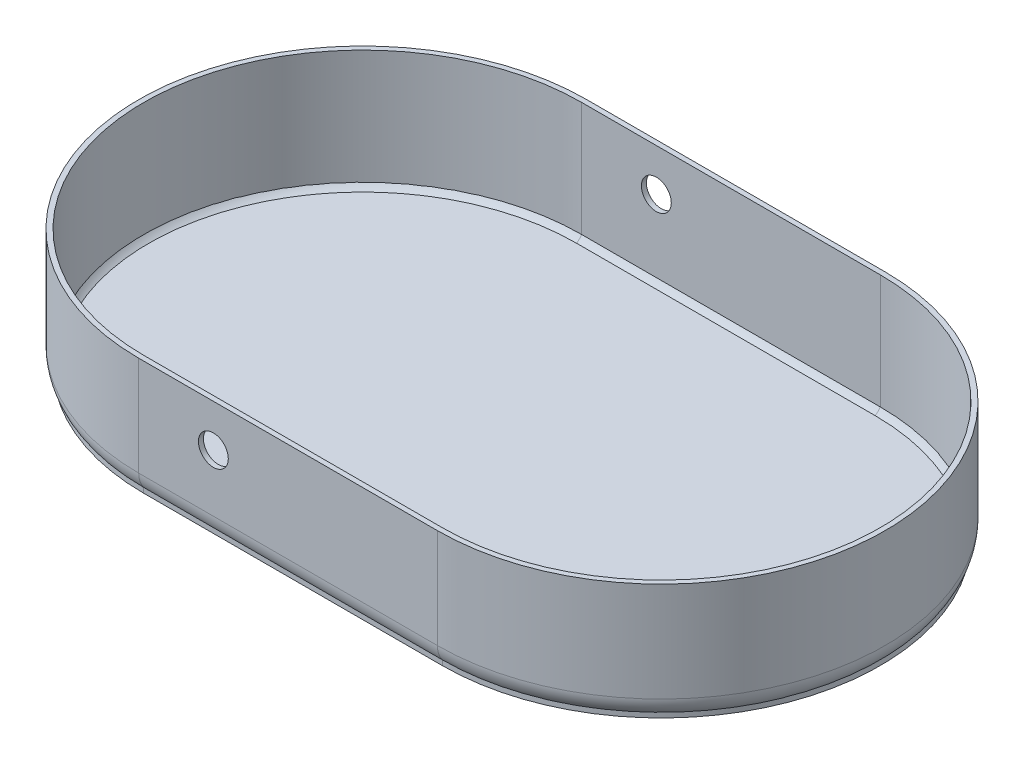
ISO-10303-21;
HEADER;
FILE_DESCRIPTION(('STEP AP214'),'2;1');
FILE_NAME('part.step','',(''),(''),'','','');
FILE_SCHEMA(('AUTOMOTIVE_DESIGN { 1 0 10303 214 1 1 1 1 }'));
ENDSEC;
DATA;
#1=APPLICATION_CONTEXT('core data for automotive mechanical design processes');
#2=APPLICATION_PROTOCOL_DEFINITION('international standard','automotive_design',2000,#1);
#3=PRODUCT_CONTEXT('',#1,'mechanical');
#4=PRODUCT('Part','Part','',(#3));
#5=PRODUCT_RELATED_PRODUCT_CATEGORY('part','',(#4));
#6=PRODUCT_DEFINITION_FORMATION('','',#4);
#7=PRODUCT_DEFINITION_CONTEXT('part definition',#1,'design');
#8=PRODUCT_DEFINITION('design','',#6,#7);
#9=PRODUCT_DEFINITION_SHAPE('','',#8);
#10=(LENGTH_UNIT() NAMED_UNIT(*) SI_UNIT(.MILLI.,.METRE.));
#11=(NAMED_UNIT(*) PLANE_ANGLE_UNIT() SI_UNIT($,.RADIAN.));
#12=(NAMED_UNIT(*) SI_UNIT($,.STERADIAN.) SOLID_ANGLE_UNIT());
#13=UNCERTAINTY_MEASURE_WITH_UNIT(LENGTH_MEASURE(1.E-05),#10,'distance_accuracy_value','');
#14=(GEOMETRIC_REPRESENTATION_CONTEXT(3) GLOBAL_UNCERTAINTY_ASSIGNED_CONTEXT((#13)) GLOBAL_UNIT_ASSIGNED_CONTEXT((#10,
#11,#12)) REPRESENTATION_CONTEXT('',''));
#15=CARTESIAN_POINT('',(0.,0.,0.));
#16=DIRECTION('',(0.,0.,1.));
#17=DIRECTION('',(1.,0.,0.));
#18=AXIS2_PLACEMENT_3D('',#15,#16,#17);
#19=CARTESIAN_POINT('',(-99.917940375915,2.,303.043690249905));
#20=DIRECTION('',(0.,1.,0.));
#21=DIRECTION('',(0.,0.,1.));
#22=AXIS2_PLACEMENT_3D('',#19,#20,#21);
#23=PLANE('',#22);
#24=DIRECTION('',(1.,0.,0.));
#25=VECTOR('',#24,1.);
#26=CARTESIAN_POINT('',(-99.917940375915,2.,215.043690249905));
#27=LINE('',#26,#25);
#28=CARTESIAN_POINT('',(-99.917940375915,2.,215.043690249905));
#29=VERTEX_POINT('',#28);
#30=CARTESIAN_POINT('',(20.0820596240851,2.,215.043690249905));
#31=VERTEX_POINT('',#30);
#32=EDGE_CURVE('E129',#29,#31,#27,.T.);
#33=ORIENTED_EDGE('',*,*,#32,.F.);
#34=CARTESIAN_POINT('',(-99.917940375915,2.,303.043690249905));
#35=DIRECTION('',(0.,1.,0.));
#36=DIRECTION('',(0.,0.,-1.));
#37=AXIS2_PLACEMENT_3D('',#34,#35,#36);
#38=CIRCLE('',#37,88.);
#39=CARTESIAN_POINT('',(-99.917940375915,2.,391.043690249905));
#40=VERTEX_POINT('',#39);
#41=EDGE_CURVE('E114',#29,#40,#38,.T.);
#42=ORIENTED_EDGE('',*,*,#41,.T.);
#43=DIRECTION('',(1.,0.,0.));
#44=VECTOR('',#43,1.);
#45=CARTESIAN_POINT('',(-99.917940375915,2.,391.043690249905));
#46=LINE('',#45,#44);
#47=CARTESIAN_POINT('',(20.0820596240851,2.,391.043690249905));
#48=VERTEX_POINT('',#47);
#49=EDGE_CURVE('E160',#40,#48,#46,.T.);
#50=ORIENTED_EDGE('',*,*,#49,.T.);
#51=CARTESIAN_POINT('',(20.0820596240851,2.,303.043690249905));
#52=DIRECTION('',(0.,1.,0.));
#53=DIRECTION('',(0.,0.,1.));
#54=AXIS2_PLACEMENT_3D('',#51,#52,#53);
#55=CIRCLE('',#54,88.);
#56=EDGE_CURVE('E131',#48,#31,#55,.T.);
#57=ORIENTED_EDGE('',*,*,#56,.T.);
#58=EDGE_LOOP('',(#33,#42,#50,#57));
#59=FACE_BOUND('',#58,.T.);
#60=ADVANCED_FACE('F37',(#59),#23,.T.);
#61=CARTESIAN_POINT('',(-99.917940375915,2.,303.043690249905));
#62=DIRECTION('',(0.,-1.,0.));
#63=DIRECTION('',(0.,0.,-1.));
#64=AXIS2_PLACEMENT_3D('',#61,#62,#63);
#65=CYLINDRICAL_SURFACE('',#64,90.);
#66=DIRECTION('',(0.,-1.,0.));
#67=VECTOR('',#66,1.);
#68=CARTESIAN_POINT('',(-99.917940375915,2.,213.043690249905));
#69=LINE('',#68,#67);
#70=CARTESIAN_POINT('',(-99.917940375915,50.,213.043690249905));
#71=VERTEX_POINT('',#70);
#72=CARTESIAN_POINT('',(-99.917940375915,10.,213.043690249905));
#73=VERTEX_POINT('',#72);
#74=EDGE_CURVE('E168',#71,#73,#69,.T.);
#75=ORIENTED_EDGE('',*,*,#74,.T.);
#76=CARTESIAN_POINT('',(-99.917940375915,10.,303.043690249905));
#77=DIRECTION('',(0.,1.,0.));
#78=DIRECTION('',(0.,0.,1.));
#79=AXIS2_PLACEMENT_3D('',#76,#77,#78);
#80=CIRCLE('',#79,90.);
#81=CARTESIAN_POINT('',(-99.917940375915,10.,393.043690249905));
#82=VERTEX_POINT('',#81);
#83=EDGE_CURVE('E11',#73,#82,#80,.T.);
#84=ORIENTED_EDGE('',*,*,#83,.T.);
#85=DIRECTION('',(0.,-1.,0.));
#86=VECTOR('',#85,1.);
#87=CARTESIAN_POINT('',(-99.917940375915,2.,393.043690249905));
#88=LINE('',#87,#86);
#89=CARTESIAN_POINT('',(-99.917940375915,50.,393.043690249905));
#90=VERTEX_POINT('',#89);
#91=EDGE_CURVE('E176',#90,#82,#88,.T.);
#92=ORIENTED_EDGE('',*,*,#91,.F.);
#93=CARTESIAN_POINT('',(-99.917940375915,50.,303.043690249905));
#94=DIRECTION('',(0.,1.,0.));
#95=DIRECTION('',(0.,0.,-1.));
#96=AXIS2_PLACEMENT_3D('',#93,#94,#95);
#97=CIRCLE('',#96,90.);
#98=EDGE_CURVE('E140',#71,#90,#97,.T.);
#99=ORIENTED_EDGE('',*,*,#98,.F.);
#100=EDGE_LOOP('',(#75,#84,#92,#99));
#101=FACE_BOUND('',#100,.T.);
#102=ADVANCED_FACE('F237',(#101),#65,.T.);
#103=CARTESIAN_POINT('',(-99.917940375915,2.,393.043690249905));
#104=DIRECTION('',(0.,0.,-1.));
#105=DIRECTION('',(-1.,0.,0.));
#106=AXIS2_PLACEMENT_3D('',#103,#104,#105);
#107=PLANE('',#106);
#108=CARTESIAN_POINT('',(-69.9179403759149,33.,393.043690249905));
#109=DIRECTION('',(0.,0.,1.));
#110=DIRECTION('',(1.,0.,0.));
#111=AXIS2_PLACEMENT_3D('',#108,#109,#110);
#112=CIRCLE('',#111,6.);
#113=CARTESIAN_POINT('',(-63.9179403759149,33.,393.043690249905));
#114=VERTEX_POINT('',#113);
#115=EDGE_CURVE('E184',#114,#114,#112,.T.);
#116=ORIENTED_EDGE('',*,*,#115,.F.);
#117=EDGE_LOOP('',(#116));
#118=FACE_BOUND('',#117,.T.);
#119=ORIENTED_EDGE('',*,*,#91,.T.);
#120=DIRECTION('',(1.,0.,0.));
#121=VECTOR('',#120,1.);
#122=CARTESIAN_POINT('',(-99.917940375915,10.,393.043690249905));
#123=LINE('',#122,#121);
#124=CARTESIAN_POINT('',(20.0820596240851,10.,393.043690249905));
#125=VERTEX_POINT('',#124);
#126=EDGE_CURVE('E179',#82,#125,#123,.T.);
#127=ORIENTED_EDGE('',*,*,#126,.T.);
#128=DIRECTION('',(0.,-1.,0.));
#129=VECTOR('',#128,1.);
#130=CARTESIAN_POINT('',(20.0820596240851,2.,393.043690249905));
#131=LINE('',#130,#129);
#132=CARTESIAN_POINT('',(20.0820596240851,50.,393.043690249905));
#133=VERTEX_POINT('',#132);
#134=EDGE_CURVE('E174',#133,#125,#131,.T.);
#135=ORIENTED_EDGE('',*,*,#134,.F.);
#136=DIRECTION('',(-1.,0.,0.));
#137=VECTOR('',#136,1.);
#138=CARTESIAN_POINT('',(-99.917940375915,50.,393.043690249905));
#139=LINE('',#138,#137);
#140=EDGE_CURVE('E158',#133,#90,#139,.T.);
#141=ORIENTED_EDGE('',*,*,#140,.T.);
#142=EDGE_LOOP('',(#119,#127,#135,#141));
#143=FACE_BOUND('',#142,.T.);
#144=ADVANCED_FACE('F242',(#118,#143),#107,.F.);
#145=CARTESIAN_POINT('',(20.0820596240851,2.,303.043690249905));
#146=DIRECTION('',(0.,-1.,0.));
#147=DIRECTION('',(0.,0.,-1.));
#148=AXIS2_PLACEMENT_3D('',#145,#146,#147);
#149=CYLINDRICAL_SURFACE('',#148,90.);
#150=ORIENTED_EDGE('',*,*,#134,.T.);
#151=CARTESIAN_POINT('',(20.0820596240851,10.,303.043690249905));
#152=DIRECTION('',(0.,1.,0.));
#153=DIRECTION('',(0.,0.,1.));
#154=AXIS2_PLACEMENT_3D('',#151,#152,#153);
#155=CIRCLE('',#154,90.);
#156=CARTESIAN_POINT('',(20.0820596240851,10.,213.043690249905));
#157=VERTEX_POINT('',#156);
#158=EDGE_CURVE('E61',#125,#157,#155,.T.);
#159=ORIENTED_EDGE('',*,*,#158,.T.);
#160=DIRECTION('',(0.,-1.,0.));
#161=VECTOR('',#160,1.);
#162=CARTESIAN_POINT('',(20.0820596240851,2.,213.043690249905));
#163=LINE('',#162,#161);
#164=CARTESIAN_POINT('',(20.0820596240851,50.,213.043690249905));
#165=VERTEX_POINT('',#164);
#166=EDGE_CURVE('E172',#165,#157,#163,.T.);
#167=ORIENTED_EDGE('',*,*,#166,.F.);
#168=CARTESIAN_POINT('',(20.0820596240851,50.,303.043690249905));
#169=DIRECTION('',(0.,1.,0.));
#170=DIRECTION('',(0.,0.,1.));
#171=AXIS2_PLACEMENT_3D('',#168,#169,#170);
#172=CIRCLE('',#171,90.);
#173=EDGE_CURVE('E151',#133,#165,#172,.T.);
#174=ORIENTED_EDGE('',*,*,#173,.F.);
#175=EDGE_LOOP('',(#150,#159,#167,#174));
#176=FACE_BOUND('',#175,.T.);
#177=ADVANCED_FACE('F254',(#176),#149,.T.);
#178=CARTESIAN_POINT('',(-99.917940375915,2.,213.043690249905));
#179=DIRECTION('',(0.,0.,-1.));
#180=DIRECTION('',(-1.,0.,0.));
#181=AXIS2_PLACEMENT_3D('',#178,#179,#180);
#182=PLANE('',#181);
#183=CARTESIAN_POINT('',(-69.9179403759149,33.,213.043690249905));
#184=DIRECTION('',(0.,0.,-1.));
#185=DIRECTION('',(-1.,0.,0.));
#186=AXIS2_PLACEMENT_3D('',#183,#184,#185);
#187=CIRCLE('',#186,6.);
#188=CARTESIAN_POINT('',(-63.9179403759149,33.,213.043690249905));
#189=VERTEX_POINT('',#188);
#190=EDGE_CURVE('E126',#189,#189,#187,.T.);
#191=ORIENTED_EDGE('',*,*,#190,.F.);
#192=EDGE_LOOP('',(#191));
#193=FACE_BOUND('',#192,.T.);
#194=ORIENTED_EDGE('',*,*,#166,.T.);
#195=DIRECTION('',(1.,0.,0.));
#196=VECTOR('',#195,1.);
#197=CARTESIAN_POINT('',(-99.917940375915,10.,213.043690249905));
#198=LINE('',#197,#196);
#199=EDGE_CURVE('E46',#157,#73,#198,.F.);
#200=ORIENTED_EDGE('',*,*,#199,.T.);
#201=ORIENTED_EDGE('',*,*,#74,.F.);
#202=DIRECTION('',(1.,0.,0.));
#203=VECTOR('',#202,1.);
#204=CARTESIAN_POINT('',(-99.917940375915,50.,213.043690249905));
#205=LINE('',#204,#203);
#206=EDGE_CURVE('E146',#71,#165,#205,.T.);
#207=ORIENTED_EDGE('',*,*,#206,.T.);
#208=EDGE_LOOP('',(#194,#200,#201,#207));
#209=FACE_BOUND('',#208,.T.);
#210=ADVANCED_FACE('F250',(#193,#209),#182,.T.);
#211=CARTESIAN_POINT('',(-99.917940375915,0.,303.043690249905));
#212=DIRECTION('',(0.,1.,0.));
#213=DIRECTION('',(0.,0.,1.));
#214=AXIS2_PLACEMENT_3D('',#211,#212,#213);
#215=PLANE('',#214);
#216=CARTESIAN_POINT('',(20.0820596240851,0.,303.043690249905));
#217=DIRECTION('',(0.,1.,0.));
#218=DIRECTION('',(0.,0.,1.));
#219=AXIS2_PLACEMENT_3D('',#216,#217,#218);
#220=CIRCLE('',#219,80.);
#221=CARTESIAN_POINT('',(20.0820596240851,0.,223.043690249905));
#222=VERTEX_POINT('',#221);
#223=CARTESIAN_POINT('',(20.0820596240851,0.,383.043690249905));
#224=VERTEX_POINT('',#223);
#225=EDGE_CURVE('E191',#222,#224,#220,.F.);
#226=ORIENTED_EDGE('',*,*,#225,.T.);
#227=DIRECTION('',(1.,0.,0.));
#228=VECTOR('',#227,1.);
#229=CARTESIAN_POINT('',(-99.917940375915,0.,383.043690249905));
#230=LINE('',#229,#228);
#231=CARTESIAN_POINT('',(-99.917940375915,0.,383.043690249905));
#232=VERTEX_POINT('',#231);
#233=EDGE_CURVE('E193',#224,#232,#230,.F.);
#234=ORIENTED_EDGE('',*,*,#233,.T.);
#235=CARTESIAN_POINT('',(-99.917940375915,0.,303.043690249905));
#236=DIRECTION('',(0.,1.,0.));
#237=DIRECTION('',(0.,0.,1.));
#238=AXIS2_PLACEMENT_3D('',#235,#236,#237);
#239=CIRCLE('',#238,80.);
#240=CARTESIAN_POINT('',(-99.917940375915,0.,223.043690249905));
#241=VERTEX_POINT('',#240);
#242=EDGE_CURVE('E187',#232,#241,#239,.F.);
#243=ORIENTED_EDGE('',*,*,#242,.T.);
#244=DIRECTION('',(1.,0.,0.));
#245=VECTOR('',#244,1.);
#246=CARTESIAN_POINT('',(20.0820596240851,0.,223.043690249905));
#247=LINE('',#246,#245);
#248=EDGE_CURVE('E189',#241,#222,#247,.T.);
#249=ORIENTED_EDGE('',*,*,#248,.T.);
#250=EDGE_LOOP('',(#226,#234,#243,#249));
#251=FACE_BOUND('',#250,.T.);
#252=ADVANCED_FACE('F247',(#251),#215,.F.);
#253=CARTESIAN_POINT('',(-99.917940375915,50.,391.043690249905));
#254=DIRECTION('',(0.,1.,0.));
#255=DIRECTION('',(0.,0.,1.));
#256=AXIS2_PLACEMENT_3D('',#253,#254,#255);
#257=PLANE('',#256);
#258=ORIENTED_EDGE('',*,*,#98,.T.);
#259=ORIENTED_EDGE('',*,*,#140,.F.);
#260=ORIENTED_EDGE('',*,*,#173,.T.);
#261=ORIENTED_EDGE('',*,*,#206,.F.);
#262=EDGE_LOOP('',(#258,#259,#260,#261));
#263=FACE_BOUND('',#262,.T.);
#264=DIRECTION('',(-1.,0.,0.));
#265=VECTOR('',#264,1.);
#266=CARTESIAN_POINT('',(-99.917940375915,50.,391.043690249905));
#267=LINE('',#266,#265);
#268=CARTESIAN_POINT('',(20.0820596240851,50.,391.043690249905));
#269=VERTEX_POINT('',#268);
#270=CARTESIAN_POINT('',(-99.917940375915,50.,391.043690249905));
#271=VERTEX_POINT('',#270);
#272=EDGE_CURVE('E165',#269,#271,#267,.T.);
#273=ORIENTED_EDGE('',*,*,#272,.T.);
#274=CARTESIAN_POINT('',(-99.917940375915,50.,303.043690249905));
#275=DIRECTION('',(0.,1.,0.));
#276=DIRECTION('',(0.,0.,-1.));
#277=AXIS2_PLACEMENT_3D('',#274,#275,#276);
#278=CIRCLE('',#277,88.);
#279=CARTESIAN_POINT('',(-99.917940375915,50.,215.043690249905));
#280=VERTEX_POINT('',#279);
#281=EDGE_CURVE('E125',#280,#271,#278,.T.);
#282=ORIENTED_EDGE('',*,*,#281,.F.);
#283=DIRECTION('',(1.,0.,0.));
#284=VECTOR('',#283,1.);
#285=CARTESIAN_POINT('',(-99.917940375915,50.,215.043690249905));
#286=LINE('',#285,#284);
#287=CARTESIAN_POINT('',(20.0820596240851,50.,215.043690249905));
#288=VERTEX_POINT('',#287);
#289=EDGE_CURVE('E135',#280,#288,#286,.T.);
#290=ORIENTED_EDGE('',*,*,#289,.T.);
#291=CARTESIAN_POINT('',(20.0820596240851,50.,303.043690249905));
#292=DIRECTION('',(0.,1.,0.));
#293=DIRECTION('',(0.,0.,1.));
#294=AXIS2_PLACEMENT_3D('',#291,#292,#293);
#295=CIRCLE('',#294,88.);
#296=EDGE_CURVE('E150',#269,#288,#295,.T.);
#297=ORIENTED_EDGE('',*,*,#296,.F.);
#298=EDGE_LOOP('',(#273,#282,#290,#297));
#299=FACE_BOUND('',#298,.T.);
#300=ADVANCED_FACE('F223',(#263,#299),#257,.T.);
#301=CARTESIAN_POINT('',(0.,0.,391.043690249905));
#302=DIRECTION('',(0.,0.,1.));
#303=DIRECTION('',(1.,0.,0.));
#304=AXIS2_PLACEMENT_3D('',#301,#302,#303);
#305=PLANE('',#304);
#306=CARTESIAN_POINT('',(-69.9179403759149,33.,391.043690249905));
#307=DIRECTION('',(0.,0.,1.));
#308=DIRECTION('',(1.,0.,0.));
#309=AXIS2_PLACEMENT_3D('',#306,#307,#308);
#310=CIRCLE('',#309,6.);
#311=CARTESIAN_POINT('',(-63.9179403759149,33.,391.043690249905));
#312=VERTEX_POINT('',#311);
#313=EDGE_CURVE('E183',#312,#312,#310,.T.);
#314=ORIENTED_EDGE('',*,*,#313,.T.);
#315=EDGE_LOOP('',(#314));
#316=FACE_BOUND('',#315,.T.);
#317=DIRECTION('',(0.,-1.,0.));
#318=VECTOR('',#317,1.);
#319=CARTESIAN_POINT('',(-99.917940375915,50.,391.043690249905));
#320=LINE('',#319,#318);
#321=EDGE_CURVE('E121',#271,#40,#320,.T.);
#322=ORIENTED_EDGE('',*,*,#321,.F.);
#323=ORIENTED_EDGE('',*,*,#272,.F.);
#324=DIRECTION('',(0.,1.,0.));
#325=VECTOR('',#324,1.);
#326=CARTESIAN_POINT('',(20.0820596240851,50.,391.043690249905));
#327=LINE('',#326,#325);
#328=EDGE_CURVE('E162',#48,#269,#327,.T.);
#329=ORIENTED_EDGE('',*,*,#328,.F.);
#330=ORIENTED_EDGE('',*,*,#49,.F.);
#331=EDGE_LOOP('',(#322,#323,#329,#330));
#332=FACE_BOUND('',#331,.T.);
#333=ADVANCED_FACE('F221',(#316,#332),#305,.F.);
#334=CARTESIAN_POINT('',(20.0820596240851,2.,303.043690249905));
#335=DIRECTION('',(0.,1.,0.));
#336=DIRECTION('',(0.,0.,1.));
#337=AXIS2_PLACEMENT_3D('',#334,#335,#336);
#338=CYLINDRICAL_SURFACE('',#337,88.);
#339=DIRECTION('',(0.,1.,0.));
#340=VECTOR('',#339,1.);
#341=CARTESIAN_POINT('',(20.0820596240851,2.,215.043690249905));
#342=LINE('',#341,#340);
#343=EDGE_CURVE('E156',#31,#288,#342,.T.);
#344=ORIENTED_EDGE('',*,*,#343,.F.);
#345=ORIENTED_EDGE('',*,*,#56,.F.);
#346=ORIENTED_EDGE('',*,*,#328,.T.);
#347=ORIENTED_EDGE('',*,*,#296,.T.);
#348=EDGE_LOOP('',(#344,#345,#346,#347));
#349=FACE_BOUND('',#348,.T.);
#350=ADVANCED_FACE('F225',(#349),#338,.F.);
#351=CARTESIAN_POINT('',(-99.917940375915,2.,215.043690249905));
#352=DIRECTION('',(0.,0.,-1.));
#353=DIRECTION('',(-1.,0.,0.));
#354=AXIS2_PLACEMENT_3D('',#351,#352,#353);
#355=PLANE('',#354);
#356=CARTESIAN_POINT('',(-69.9179403759149,33.,215.043690249905));
#357=DIRECTION('',(0.,0.,-1.));
#358=DIRECTION('',(-1.,0.,0.));
#359=AXIS2_PLACEMENT_3D('',#356,#357,#358);
#360=CIRCLE('',#359,6.);
#361=CARTESIAN_POINT('',(-63.9179403759149,33.,215.043690249905));
#362=VERTEX_POINT('',#361);
#363=EDGE_CURVE('E180',#362,#362,#360,.T.);
#364=ORIENTED_EDGE('',*,*,#363,.T.);
#365=EDGE_LOOP('',(#364));
#366=FACE_BOUND('',#365,.T.);
#367=ORIENTED_EDGE('',*,*,#289,.F.);
#368=DIRECTION('',(0.,1.,0.));
#369=VECTOR('',#368,1.);
#370=CARTESIAN_POINT('',(-99.917940375915,2.,215.043690249905));
#371=LINE('',#370,#369);
#372=EDGE_CURVE('E118',#29,#280,#371,.T.);
#373=ORIENTED_EDGE('',*,*,#372,.F.);
#374=ORIENTED_EDGE('',*,*,#32,.T.);
#375=ORIENTED_EDGE('',*,*,#343,.T.);
#376=EDGE_LOOP('',(#367,#373,#374,#375));
#377=FACE_BOUND('',#376,.T.);
#378=ADVANCED_FACE('F138',(#366,#377),#355,.F.);
#379=CARTESIAN_POINT('',(-99.917940375915,2.,303.043690249905));
#380=DIRECTION('',(0.,1.,0.));
#381=DIRECTION('',(0.,0.,1.));
#382=AXIS2_PLACEMENT_3D('',#379,#380,#381);
#383=CYLINDRICAL_SURFACE('',#382,88.);
#384=ORIENTED_EDGE('',*,*,#281,.T.);
#385=ORIENTED_EDGE('',*,*,#321,.T.);
#386=ORIENTED_EDGE('',*,*,#41,.F.);
#387=ORIENTED_EDGE('',*,*,#372,.T.);
#388=EDGE_LOOP('',(#384,#385,#386,#387));
#389=FACE_BOUND('',#388,.T.);
#390=ADVANCED_FACE('F116',(#389),#383,.F.);
#391=CARTESIAN_POINT('',(-69.9179403759149,33.,188.043690249905));
#392=DIRECTION('',(0.,0.,1.));
#393=DIRECTION('',(1.,0.,0.));
#394=AXIS2_PLACEMENT_3D('',#391,#392,#393);
#395=CYLINDRICAL_SURFACE('',#394,6.);
#396=CARTESIAN_POINT('',(-63.9179403759149,33.,213.043690249905));
#397=CARTESIAN_POINT('',(-63.9179403759149,33.,213.064523583238));
#398=CARTESIAN_POINT('',(-63.9179403759149,33.,213.085356916572));
#399=CARTESIAN_POINT('',(-63.9179403759149,33.,213.127023583238));
#400=CARTESIAN_POINT('',(-63.9179403759149,33.,213.147856916572));
#401=CARTESIAN_POINT('',(-63.9179403759149,33.,213.189523583238));
#402=CARTESIAN_POINT('',(-63.9179403759149,33.,213.210356916572));
#403=CARTESIAN_POINT('',(-63.9179403759149,33.,213.252023583238));
#404=CARTESIAN_POINT('',(-63.9179403759149,33.,213.272856916572));
#405=CARTESIAN_POINT('',(-63.9179403759149,33.,213.314523583238));
#406=CARTESIAN_POINT('',(-63.9179403759149,33.,213.335356916572));
#407=CARTESIAN_POINT('',(-63.9179403759149,33.,213.377023583238));
#408=CARTESIAN_POINT('',(-63.9179403759149,33.,213.397856916572));
#409=CARTESIAN_POINT('',(-63.9179403759149,33.,213.439523583238));
#410=CARTESIAN_POINT('',(-63.9179403759149,33.,213.460356916572));
#411=CARTESIAN_POINT('',(-63.9179403759149,33.,213.502023583238));
#412=CARTESIAN_POINT('',(-63.9179403759149,33.,213.522856916572));
#413=CARTESIAN_POINT('',(-63.9179403759149,33.,213.564523583238));
#414=CARTESIAN_POINT('',(-63.9179403759149,33.,213.585356916572));
#415=CARTESIAN_POINT('',(-63.9179403759149,33.,213.627023583238));
#416=CARTESIAN_POINT('',(-63.9179403759149,33.,213.647856916572));
#417=CARTESIAN_POINT('',(-63.9179403759149,33.,213.689523583238));
#418=CARTESIAN_POINT('',(-63.9179403759149,33.,213.710356916572));
#419=CARTESIAN_POINT('',(-63.9179403759149,33.,213.752023583238));
#420=CARTESIAN_POINT('',(-63.9179403759149,33.,213.772856916572));
#421=CARTESIAN_POINT('',(-63.9179403759149,33.,213.814523583238));
#422=CARTESIAN_POINT('',(-63.9179403759149,33.,213.835356916572));
#423=CARTESIAN_POINT('',(-63.9179403759149,33.,213.877023583238));
#424=CARTESIAN_POINT('',(-63.9179403759149,33.,213.897856916572));
#425=CARTESIAN_POINT('',(-63.9179403759149,33.,213.939523583238));
#426=CARTESIAN_POINT('',(-63.9179403759149,33.,213.960356916572));
#427=CARTESIAN_POINT('',(-63.9179403759149,33.,214.002023583238));
#428=CARTESIAN_POINT('',(-63.9179403759149,33.,214.022856916572));
#429=CARTESIAN_POINT('',(-63.9179403759149,33.,214.064523583238));
#430=CARTESIAN_POINT('',(-63.9179403759149,33.,214.085356916572));
#431=CARTESIAN_POINT('',(-63.9179403759149,33.,214.127023583238));
#432=CARTESIAN_POINT('',(-63.9179403759149,33.,214.147856916572));
#433=CARTESIAN_POINT('',(-63.9179403759149,33.,214.189523583238));
#434=CARTESIAN_POINT('',(-63.9179403759149,33.,214.210356916572));
#435=CARTESIAN_POINT('',(-63.9179403759149,33.,214.252023583238));
#436=CARTESIAN_POINT('',(-63.9179403759149,33.,214.272856916572));
#437=CARTESIAN_POINT('',(-63.9179403759149,33.,214.314523583238));
#438=CARTESIAN_POINT('',(-63.9179403759149,33.,214.335356916572));
#439=CARTESIAN_POINT('',(-63.9179403759149,33.,214.377023583238));
#440=CARTESIAN_POINT('',(-63.9179403759149,33.,214.397856916572));
#441=CARTESIAN_POINT('',(-63.9179403759149,33.,214.439523583238));
#442=CARTESIAN_POINT('',(-63.9179403759149,33.,214.460356916572));
#443=CARTESIAN_POINT('',(-63.9179403759149,33.,214.502023583238));
#444=CARTESIAN_POINT('',(-63.9179403759149,33.,214.522856916572));
#445=CARTESIAN_POINT('',(-63.9179403759149,33.,214.564523583238));
#446=CARTESIAN_POINT('',(-63.9179403759149,33.,214.585356916572));
#447=CARTESIAN_POINT('',(-63.9179403759149,33.,214.627023583238));
#448=CARTESIAN_POINT('',(-63.9179403759149,33.,214.647856916572));
#449=CARTESIAN_POINT('',(-63.9179403759149,33.,214.689523583238));
#450=CARTESIAN_POINT('',(-63.9179403759149,33.,214.710356916572));
#451=CARTESIAN_POINT('',(-63.9179403759149,33.,214.752023583238));
#452=CARTESIAN_POINT('',(-63.9179403759149,33.,214.772856916572));
#453=CARTESIAN_POINT('',(-63.9179403759149,33.,214.814523583238));
#454=CARTESIAN_POINT('',(-63.9179403759149,33.,214.835356916572));
#455=CARTESIAN_POINT('',(-63.9179403759149,33.,214.877023583238));
#456=CARTESIAN_POINT('',(-63.9179403759149,33.,214.897856916572));
#457=CARTESIAN_POINT('',(-63.9179403759149,33.,214.939523583238));
#458=CARTESIAN_POINT('',(-63.9179403759149,33.,214.960356916572));
#459=CARTESIAN_POINT('',(-63.9179403759149,33.,215.002023583238));
#460=CARTESIAN_POINT('',(-63.9179403759149,33.,215.022856916572));
#461=CARTESIAN_POINT('',(-63.9179403759149,33.,215.043690249905));
#462=B_SPLINE_CURVE_WITH_KNOTS('',3,(#396,#397,#398,#399,#400,#401,#402,#403,#404,#405,#406,
#407,#408,#409,#410,#411,#412,#413,#414,#415,#416,#417,#418,#419,#420,#421,#422,#423,#424,#425,
#426,#427,#428,#429,#430,#431,#432,#433,#434,#435,#436,#437,#438,#439,#440,#441,#442,#443,#444,
#445,#446,#447,#448,#449,#450,#451,#452,#453,#454,#455,#456,#457,#458,#459,#460,#461),
.UNSPECIFIED.,.F.,.F.,(4,2,2,2,2,2,2,2,2,2,2,2,2,2,2,2,2,2,2,2,2,2,2,2,2,2,2,2,2,2,2,2,4),(0.,
0.0624999999999931,0.124999999999986,0.187499999999979,0.25,0.312499999999993,0.374999999999986,
0.43749999999998,0.5,0.562499999999994,0.624999999999987,0.68749999999998,0.750000000000001,
0.812499999999994,0.874999999999987,0.93749999999998,1.,1.06249999999999,1.12499999999999,
1.18749999999998,1.25,1.31249999999999,1.37499999999999,1.43749999999998,1.5,1.56249999999999,
1.62499999999999,1.68749999999998,1.75,1.81249999999999,1.87499999999999,1.93749999999998,2.),.UNSPECIFIED.);
#463=EDGE_CURVE('BSEAM277',#189,#362,#462,.T.);
#464=ORIENTED_EDGE('',*,*,#190,.T.);
#465=ORIENTED_EDGE('',*,*,#363,.F.);
#466=ORIENTED_EDGE('',*,*,#463,.T.);
#467=ORIENTED_EDGE('',*,*,#463,.F.);
#468=EDGE_LOOP('',(#464,#466,#465,#467));
#469=FACE_BOUND('',#468,.T.);
#470=ADVANCED_FACE('F277',(#469),#395,.F.);
#471=CARTESIAN_POINT('',(-63.9179403759149,33.,393.043690249905));
#472=CARTESIAN_POINT('',(-63.9179403759149,33.,393.022856916572));
#473=CARTESIAN_POINT('',(-63.9179403759149,33.,393.002023583238));
#474=CARTESIAN_POINT('',(-63.9179403759149,33.,392.960356916572));
#475=CARTESIAN_POINT('',(-63.9179403759149,33.,392.939523583238));
#476=CARTESIAN_POINT('',(-63.9179403759149,33.,392.897856916572));
#477=CARTESIAN_POINT('',(-63.9179403759149,33.,392.877023583238));
#478=CARTESIAN_POINT('',(-63.9179403759149,33.,392.835356916572));
#479=CARTESIAN_POINT('',(-63.9179403759149,33.,392.814523583238));
#480=CARTESIAN_POINT('',(-63.9179403759149,33.,392.772856916572));
#481=CARTESIAN_POINT('',(-63.9179403759149,33.,392.752023583238));
#482=CARTESIAN_POINT('',(-63.9179403759149,33.,392.710356916572));
#483=CARTESIAN_POINT('',(-63.9179403759149,33.,392.689523583238));
#484=CARTESIAN_POINT('',(-63.9179403759149,33.,392.647856916572));
#485=CARTESIAN_POINT('',(-63.9179403759149,33.,392.627023583238));
#486=CARTESIAN_POINT('',(-63.9179403759149,33.,392.585356916572));
#487=CARTESIAN_POINT('',(-63.9179403759149,33.,392.564523583238));
#488=CARTESIAN_POINT('',(-63.9179403759149,33.,392.522856916572));
#489=CARTESIAN_POINT('',(-63.9179403759149,33.,392.502023583238));
#490=CARTESIAN_POINT('',(-63.9179403759149,33.,392.460356916572));
#491=CARTESIAN_POINT('',(-63.9179403759149,33.,392.439523583238));
#492=CARTESIAN_POINT('',(-63.9179403759149,33.,392.397856916572));
#493=CARTESIAN_POINT('',(-63.9179403759149,33.,392.377023583238));
#494=CARTESIAN_POINT('',(-63.9179403759149,33.,392.335356916572));
#495=CARTESIAN_POINT('',(-63.9179403759149,33.,392.314523583238));
#496=CARTESIAN_POINT('',(-63.9179403759149,33.,392.272856916572));
#497=CARTESIAN_POINT('',(-63.9179403759149,33.,392.252023583238));
#498=CARTESIAN_POINT('',(-63.9179403759149,33.,392.210356916572));
#499=CARTESIAN_POINT('',(-63.9179403759149,33.,392.189523583238));
#500=CARTESIAN_POINT('',(-63.9179403759149,33.,392.147856916572));
#501=CARTESIAN_POINT('',(-63.9179403759149,33.,392.127023583238));
#502=CARTESIAN_POINT('',(-63.9179403759149,33.,392.085356916572));
#503=CARTESIAN_POINT('',(-63.9179403759149,33.,392.064523583238));
#504=CARTESIAN_POINT('',(-63.9179403759149,33.,392.022856916572));
#505=CARTESIAN_POINT('',(-63.9179403759149,33.,392.002023583238));
#506=CARTESIAN_POINT('',(-63.9179403759149,33.,391.960356916572));
#507=CARTESIAN_POINT('',(-63.9179403759149,33.,391.939523583238));
#508=CARTESIAN_POINT('',(-63.9179403759149,33.,391.897856916572));
#509=CARTESIAN_POINT('',(-63.9179403759149,33.,391.877023583238));
#510=CARTESIAN_POINT('',(-63.9179403759149,33.,391.835356916572));
#511=CARTESIAN_POINT('',(-63.9179403759149,33.,391.814523583238));
#512=CARTESIAN_POINT('',(-63.9179403759149,33.,391.772856916572));
#513=CARTESIAN_POINT('',(-63.9179403759149,33.,391.752023583238));
#514=CARTESIAN_POINT('',(-63.9179403759149,33.,391.710356916572));
#515=CARTESIAN_POINT('',(-63.9179403759149,33.,391.689523583238));
#516=CARTESIAN_POINT('',(-63.9179403759149,33.,391.647856916572));
#517=CARTESIAN_POINT('',(-63.9179403759149,33.,391.627023583238));
#518=CARTESIAN_POINT('',(-63.9179403759149,33.,391.585356916572));
#519=CARTESIAN_POINT('',(-63.9179403759149,33.,391.564523583238));
#520=CARTESIAN_POINT('',(-63.9179403759149,33.,391.522856916572));
#521=CARTESIAN_POINT('',(-63.9179403759149,33.,391.502023583238));
#522=CARTESIAN_POINT('',(-63.9179403759149,33.,391.460356916572));
#523=CARTESIAN_POINT('',(-63.9179403759149,33.,391.439523583238));
#524=CARTESIAN_POINT('',(-63.9179403759149,33.,391.397856916572));
#525=CARTESIAN_POINT('',(-63.9179403759149,33.,391.377023583238));
#526=CARTESIAN_POINT('',(-63.9179403759149,33.,391.335356916572));
#527=CARTESIAN_POINT('',(-63.9179403759149,33.,391.314523583238));
#528=CARTESIAN_POINT('',(-63.9179403759149,33.,391.272856916572));
#529=CARTESIAN_POINT('',(-63.9179403759149,33.,391.252023583238));
#530=CARTESIAN_POINT('',(-63.9179403759149,33.,391.210356916572));
#531=CARTESIAN_POINT('',(-63.9179403759149,33.,391.189523583238));
#532=CARTESIAN_POINT('',(-63.9179403759149,33.,391.147856916572));
#533=CARTESIAN_POINT('',(-63.9179403759149,33.,391.127023583238));
#534=CARTESIAN_POINT('',(-63.9179403759149,33.,391.085356916572));
#535=CARTESIAN_POINT('',(-63.9179403759149,33.,391.064523583238));
#536=CARTESIAN_POINT('',(-63.9179403759149,33.,391.043690249905));
#537=B_SPLINE_CURVE_WITH_KNOTS('',3,(#471,#472,#473,#474,#475,#476,#477,#478,#479,#480,#481,
#482,#483,#484,#485,#486,#487,#488,#489,#490,#491,#492,#493,#494,#495,#496,#497,#498,#499,#500,
#501,#502,#503,#504,#505,#506,#507,#508,#509,#510,#511,#512,#513,#514,#515,#516,#517,#518,#519,
#520,#521,#522,#523,#524,#525,#526,#527,#528,#529,#530,#531,#532,#533,#534,#535,#536),
.UNSPECIFIED.,.F.,.F.,(4,2,2,2,2,2,2,2,2,2,2,2,2,2,2,2,2,2,2,2,2,2,2,2,2,2,2,2,2,2,2,2,4),(0.,
0.0625000000000209,0.124999999999986,0.187500000000007,0.250000000000028,0.312499999999993,
0.375000000000014,0.437500000000035,0.5,0.562499999999966,0.624999999999987,0.687500000000008,
0.749999999999973,0.812499999999994,0.875000000000015,0.93749999999998,1.,1.06250000000002,
1.12499999999999,1.18750000000001,1.25000000000003,1.31249999999999,1.37500000000002,
1.43750000000004,1.5,1.56249999999997,1.62499999999999,1.68750000000001,1.74999999999997,
1.81249999999999,1.87500000000002,1.93749999999998,2.),.UNSPECIFIED.);
#538=EDGE_CURVE('BSEAM272',#114,#312,#537,.T.);
#539=ORIENTED_EDGE('',*,*,#115,.T.);
#540=ORIENTED_EDGE('',*,*,#313,.F.);
#541=ORIENTED_EDGE('',*,*,#538,.T.);
#542=ORIENTED_EDGE('',*,*,#538,.F.);
#543=EDGE_LOOP('',(#539,#541,#540,#542));
#544=FACE_BOUND('',#543,.T.);
#545=ADVANCED_FACE('F272',(#544),#395,.F.);
#546=CARTESIAN_POINT('',(-99.917940375915,10.,223.043690249905));
#547=DIRECTION('',(-1.,0.,0.));
#548=DIRECTION('',(0.,0.,1.));
#549=AXIS2_PLACEMENT_3D('',#546,#547,#548);
#550=CYLINDRICAL_SURFACE('',#549,10.);
#551=CARTESIAN_POINT('',(20.0820596240851,10.,223.043690249905));
#552=DIRECTION('',(1.,0.,0.));
#553=DIRECTION('',(0.,0.,-1.));
#554=AXIS2_PLACEMENT_3D('',#551,#552,#553);
#555=CIRCLE('',#554,10.);
#556=EDGE_CURVE('E201',#222,#157,#555,.T.);
#557=ORIENTED_EDGE('',*,*,#556,.F.);
#558=ORIENTED_EDGE('',*,*,#248,.F.);
#559=CARTESIAN_POINT('',(-99.917940375915,10.,223.043690249905));
#560=DIRECTION('',(-1.,0.,0.));
#561=DIRECTION('',(0.,0.,1.));
#562=AXIS2_PLACEMENT_3D('',#559,#560,#561);
#563=CIRCLE('',#562,10.);
#564=EDGE_CURVE('E41',#73,#241,#563,.T.);
#565=ORIENTED_EDGE('',*,*,#564,.F.);
#566=ORIENTED_EDGE('',*,*,#199,.F.);
#567=EDGE_LOOP('',(#557,#558,#565,#566));
#568=FACE_BOUND('',#567,.T.);
#569=ADVANCED_FACE('F39',(#568),#550,.T.);
#570=CARTESIAN_POINT('',(-99.917940375915,10.,303.043690249905));
#571=DIRECTION('',(0.,1.,0.));
#572=DIRECTION('',(0.,0.,1.));
#573=AXIS2_PLACEMENT_3D('',#570,#571,#572);
#574=TOROIDAL_SURFACE('',#573,80.,10.);
#575=ORIENTED_EDGE('',*,*,#564,.T.);
#576=ORIENTED_EDGE('',*,*,#242,.F.);
#577=CARTESIAN_POINT('',(-99.917940375915,10.,383.043690249905));
#578=DIRECTION('',(1.,0.,0.));
#579=DIRECTION('',(0.,0.,-1.));
#580=AXIS2_PLACEMENT_3D('',#577,#578,#579);
#581=CIRCLE('',#580,10.);
#582=EDGE_CURVE('E200',#82,#232,#581,.T.);
#583=ORIENTED_EDGE('',*,*,#582,.F.);
#584=ORIENTED_EDGE('',*,*,#83,.F.);
#585=EDGE_LOOP('',(#575,#576,#583,#584));
#586=FACE_BOUND('',#585,.T.);
#587=ADVANCED_FACE('F267',(#586),#574,.T.);
#588=CARTESIAN_POINT('',(20.0820596240851,10.,303.043690249905));
#589=DIRECTION('',(0.,1.,0.));
#590=DIRECTION('',(0.,0.,1.));
#591=AXIS2_PLACEMENT_3D('',#588,#589,#590);
#592=TOROIDAL_SURFACE('',#591,80.,10.);
#593=ORIENTED_EDGE('',*,*,#556,.T.);
#594=ORIENTED_EDGE('',*,*,#158,.F.);
#595=CARTESIAN_POINT('',(20.0820596240851,10.,383.043690249905));
#596=DIRECTION('',(-1.,0.,0.));
#597=DIRECTION('',(0.,0.,1.));
#598=AXIS2_PLACEMENT_3D('',#595,#596,#597);
#599=CIRCLE('',#598,10.);
#600=EDGE_CURVE('E198',#224,#125,#599,.T.);
#601=ORIENTED_EDGE('',*,*,#600,.F.);
#602=ORIENTED_EDGE('',*,*,#225,.F.);
#603=EDGE_LOOP('',(#593,#594,#601,#602));
#604=FACE_BOUND('',#603,.T.);
#605=ADVANCED_FACE('F264',(#604),#592,.T.);
#606=CARTESIAN_POINT('',(-99.917940375915,10.,383.043690249905));
#607=DIRECTION('',(1.,0.,0.));
#608=DIRECTION('',(0.,0.,-1.));
#609=AXIS2_PLACEMENT_3D('',#606,#607,#608);
#610=CYLINDRICAL_SURFACE('',#609,10.);
#611=ORIENTED_EDGE('',*,*,#582,.T.);
#612=ORIENTED_EDGE('',*,*,#233,.F.);
#613=ORIENTED_EDGE('',*,*,#600,.T.);
#614=ORIENTED_EDGE('',*,*,#126,.F.);
#615=EDGE_LOOP('',(#611,#612,#613,#614));
#616=FACE_BOUND('',#615,.T.);
#617=ADVANCED_FACE('F261',(#616),#610,.T.);
#618=CLOSED_SHELL('',(#60,#102,#144,#177,#210,#252,#300,#333,#350,#378,#390,#470,#545,#569,#587,
#605,#617));
#619=MANIFOLD_SOLID_BREP('B2',#618);
#620=ADVANCED_BREP_SHAPE_REPRESENTATION('',(#18,#619),#14);
#621=SHAPE_DEFINITION_REPRESENTATION(#9,#620);
ENDSEC;
END-ISO-10303-21;
